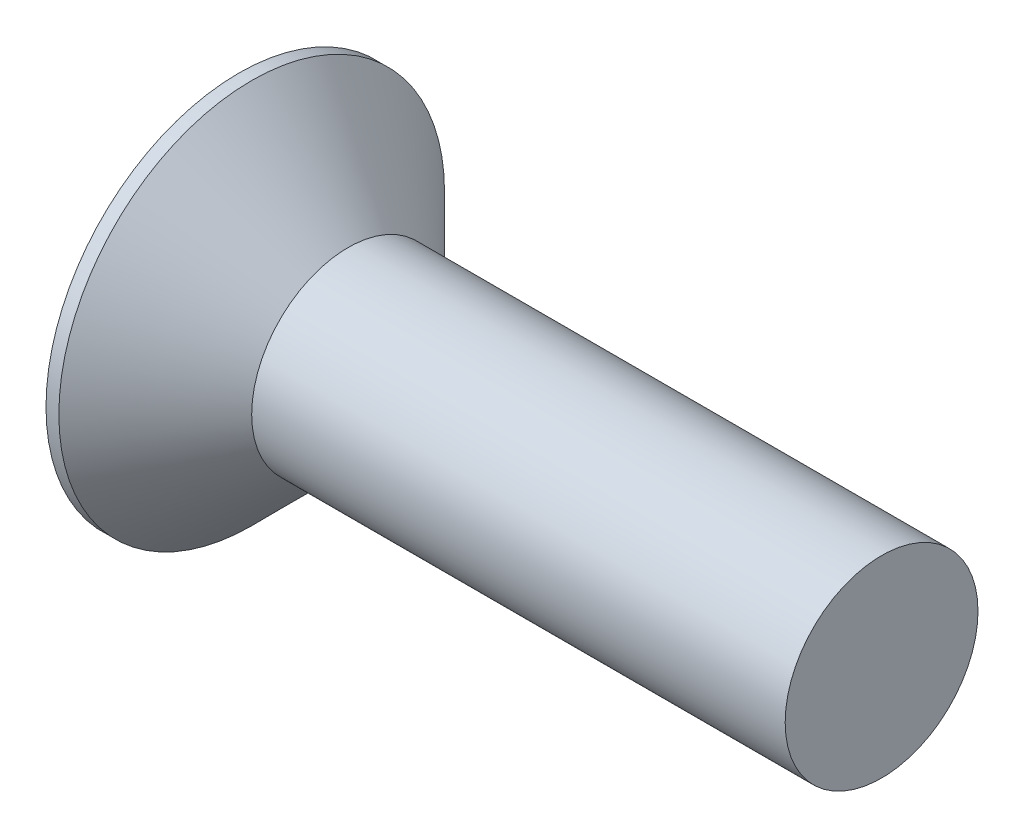
ISO-10303-21;
HEADER;
FILE_DESCRIPTION(('STEP AP214'),'2;1');
FILE_NAME('part.step','',(''),(''),'','','');
FILE_SCHEMA(('AUTOMOTIVE_DESIGN { 1 0 10303 214 1 1 1 1 }'));
ENDSEC;
DATA;
#1=APPLICATION_CONTEXT('core data for automotive mechanical design processes');
#2=APPLICATION_PROTOCOL_DEFINITION('international standard','automotive_design',2000,#1);
#3=PRODUCT_CONTEXT('',#1,'mechanical');
#4=PRODUCT('Part','Part','',(#3));
#5=PRODUCT_RELATED_PRODUCT_CATEGORY('part','',(#4));
#6=PRODUCT_DEFINITION_FORMATION('','',#4);
#7=PRODUCT_DEFINITION_CONTEXT('part definition',#1,'design');
#8=PRODUCT_DEFINITION('design','',#6,#7);
#9=PRODUCT_DEFINITION_SHAPE('','',#8);
#10=(LENGTH_UNIT() NAMED_UNIT(*) SI_UNIT(.MILLI.,.METRE.));
#11=(NAMED_UNIT(*) PLANE_ANGLE_UNIT() SI_UNIT($,.RADIAN.));
#12=(NAMED_UNIT(*) SI_UNIT($,.STERADIAN.) SOLID_ANGLE_UNIT());
#13=UNCERTAINTY_MEASURE_WITH_UNIT(LENGTH_MEASURE(1.E-05),#10,'distance_accuracy_value','');
#14=(GEOMETRIC_REPRESENTATION_CONTEXT(3) GLOBAL_UNCERTAINTY_ASSIGNED_CONTEXT((#13)) GLOBAL_UNIT_ASSIGNED_CONTEXT((#10,
#11,#12)) REPRESENTATION_CONTEXT('',''));
#15=CARTESIAN_POINT('',(0.,0.,0.));
#16=DIRECTION('',(0.,0.,1.));
#17=DIRECTION('',(1.,0.,0.));
#18=AXIS2_PLACEMENT_3D('',#15,#16,#17);
#19=CARTESIAN_POINT('',(-1.7,0.,0.));
#20=DIRECTION('',(1.,0.,0.));
#21=DIRECTION('',(0.,0.,-1.));
#22=AXIS2_PLACEMENT_3D('',#19,#20,#21);
#23=PLANE('',#22);
#24=DIRECTION('',(0.,-0.5,-0.866025403784439));
#25=VECTOR('',#24,1.);
#26=CARTESIAN_POINT('',(-1.7,1.15470053837925,0.));
#27=LINE('',#26,#25);
#28=CARTESIAN_POINT('',(-1.7,1.15470053837925,0.));
#29=VERTEX_POINT('',#28);
#30=CARTESIAN_POINT('',(-1.7,0.577350269189626,-1.));
#31=VERTEX_POINT('',#30);
#32=EDGE_CURVE('E55',#29,#31,#27,.T.);
#33=ORIENTED_EDGE('',*,*,#32,.F.);
#34=DIRECTION('',(0.,0.5,-0.866025403784439));
#35=VECTOR('',#34,1.);
#36=CARTESIAN_POINT('',(-1.7,0.577350269189626,1.));
#37=LINE('',#36,#35);
#38=CARTESIAN_POINT('',(-1.7,0.577350269189626,1.));
#39=VERTEX_POINT('',#38);
#40=EDGE_CURVE('E129',#39,#29,#37,.T.);
#41=ORIENTED_EDGE('',*,*,#40,.F.);
#42=DIRECTION('',(0.,1.,0.));
#43=VECTOR('',#42,1.);
#44=CARTESIAN_POINT('',(-1.7,-0.577350269189626,1.));
#45=LINE('',#44,#43);
#46=CARTESIAN_POINT('',(-1.7,-0.577350269189626,1.));
#47=VERTEX_POINT('',#46);
#48=EDGE_CURVE('E123',#47,#39,#45,.T.);
#49=ORIENTED_EDGE('',*,*,#48,.F.);
#50=DIRECTION('',(0.,0.5,0.866025403784439));
#51=VECTOR('',#50,1.);
#52=CARTESIAN_POINT('',(-1.7,-1.15470053837925,0.));
#53=LINE('',#52,#51);
#54=CARTESIAN_POINT('',(-1.7,-1.15470053837925,0.));
#55=VERTEX_POINT('',#54);
#56=EDGE_CURVE('E163',#55,#47,#53,.T.);
#57=ORIENTED_EDGE('',*,*,#56,.F.);
#58=DIRECTION('',(0.,-0.5,0.866025403784438));
#59=VECTOR('',#58,1.);
#60=CARTESIAN_POINT('',(-1.7,-0.577350269189626,-1.));
#61=LINE('',#60,#59);
#62=CARTESIAN_POINT('',(-1.7,-0.577350269189626,-1.));
#63=VERTEX_POINT('',#62);
#64=EDGE_CURVE('E160',#63,#55,#61,.T.);
#65=ORIENTED_EDGE('',*,*,#64,.F.);
#66=DIRECTION('',(0.,-1.,0.));
#67=VECTOR('',#66,1.);
#68=CARTESIAN_POINT('',(-1.7,0.577350269189626,-1.));
#69=LINE('',#68,#67);
#70=EDGE_CURVE('E157',#31,#63,#69,.T.);
#71=ORIENTED_EDGE('',*,*,#70,.F.);
#72=EDGE_LOOP('',(#33,#41,#49,#57,#65,#71));
#73=FACE_BOUND('',#72,.T.);
#74=CARTESIAN_POINT('',(-1.7,0.,0.));
#75=DIRECTION('',(-1.,0.,0.));
#76=DIRECTION('',(0.,0.,1.));
#77=AXIS2_PLACEMENT_3D('',#74,#75,#76);
#78=CIRCLE('',#77,3.);
#79=CARTESIAN_POINT('',(-1.7,0.,3.));
#80=VERTEX_POINT('',#79);
#81=EDGE_CURVE('E11',#80,#80,#78,.T.);
#82=ORIENTED_EDGE('',*,*,#81,.T.);
#83=EDGE_LOOP('',(#82));
#84=FACE_BOUND('',#83,.T.);
#85=ADVANCED_FACE('F41',(#73,#84),#23,.F.);
#86=CARTESIAN_POINT('',(-1.7,0.,0.));
#87=DIRECTION('',(-1.,0.,0.));
#88=DIRECTION('',(0.,0.,1.));
#89=AXIS2_PLACEMENT_3D('',#86,#87,#88);
#90=CYLINDRICAL_SURFACE('',#89,3.);
#91=ORIENTED_EDGE('',*,*,#81,.F.);
#92=EDGE_LOOP('',(#91));
#93=FACE_BOUND('',#92,.T.);
#94=CARTESIAN_POINT('',(-1.5,0.,0.));
#95=DIRECTION('',(-1.,0.,0.));
#96=DIRECTION('',(0.,0.,1.));
#97=AXIS2_PLACEMENT_3D('',#94,#95,#96);
#98=CIRCLE('',#97,3.);
#99=CARTESIAN_POINT('',(-1.5,0.,3.));
#100=VERTEX_POINT('',#99);
#101=EDGE_CURVE('E48',#100,#100,#98,.T.);
#102=ORIENTED_EDGE('',*,*,#101,.T.);
#103=EDGE_LOOP('',(#102));
#104=FACE_BOUND('',#103,.T.);
#105=ADVANCED_FACE('F191',(#93,#104),#90,.T.);
#106=CARTESIAN_POINT('',(0.,0.,0.));
#107=DIRECTION('',(-1.,0.,0.));
#108=DIRECTION('',(0.,0.,1.));
#109=AXIS2_PLACEMENT_3D('',#106,#107,#108);
#110=CONICAL_SURFACE('',#109,1.5,0.785398163397448);
#111=ORIENTED_EDGE('',*,*,#101,.F.);
#112=EDGE_LOOP('',(#111));
#113=FACE_BOUND('',#112,.T.);
#114=CARTESIAN_POINT('',(0.,0.,0.));
#115=DIRECTION('',(-1.,0.,0.));
#116=DIRECTION('',(0.,0.,1.));
#117=AXIS2_PLACEMENT_3D('',#114,#115,#116);
#118=CIRCLE('',#117,1.5);
#119=CARTESIAN_POINT('',(0.,0.,1.5));
#120=VERTEX_POINT('',#119);
#121=EDGE_CURVE('E186',#120,#120,#118,.T.);
#122=ORIENTED_EDGE('',*,*,#121,.T.);
#123=EDGE_LOOP('',(#122));
#124=FACE_BOUND('',#123,.T.);
#125=ADVANCED_FACE('F193',(#113,#124),#110,.T.);
#126=CARTESIAN_POINT('',(-1.7,0.,0.));
#127=DIRECTION('',(-1.,0.,0.));
#128=DIRECTION('',(0.,0.,1.));
#129=AXIS2_PLACEMENT_3D('',#126,#127,#128);
#130=CYLINDRICAL_SURFACE('',#129,1.5);
#131=ORIENTED_EDGE('',*,*,#121,.F.);
#132=EDGE_LOOP('',(#131));
#133=FACE_BOUND('',#132,.T.);
#134=CARTESIAN_POINT('',(8.3,0.,0.));
#135=DIRECTION('',(-1.,0.,0.));
#136=DIRECTION('',(0.,0.,1.));
#137=AXIS2_PLACEMENT_3D('',#134,#135,#136);
#138=CIRCLE('',#137,1.5);
#139=CARTESIAN_POINT('',(8.3,0.,1.5));
#140=VERTEX_POINT('',#139);
#141=EDGE_CURVE('E182',#140,#140,#138,.T.);
#142=ORIENTED_EDGE('',*,*,#141,.T.);
#143=EDGE_LOOP('',(#142));
#144=FACE_BOUND('',#143,.T.);
#145=ADVANCED_FACE('F196',(#133,#144),#130,.T.);
#146=CARTESIAN_POINT('',(8.3,1.5,0.));
#147=DIRECTION('',(-1.,0.,0.));
#148=DIRECTION('',(0.,0.,1.));
#149=AXIS2_PLACEMENT_3D('',#146,#147,#148);
#150=PLANE('',#149);
#151=ORIENTED_EDGE('',*,*,#141,.F.);
#152=EDGE_LOOP('',(#151));
#153=FACE_BOUND('',#152,.T.);
#154=ADVANCED_FACE('F202',(#153),#150,.F.);
#155=CARTESIAN_POINT('',(-0.85,0.577350269189626,1.));
#156=DIRECTION('',(0.,0.866025403784439,0.5));
#157=DIRECTION('',(0.,-0.5,0.866025403784439));
#158=AXIS2_PLACEMENT_3D('',#155,#156,#157);
#159=PLANE('',#158);
#160=DIRECTION('',(0.,0.5,-0.866025403784439));
#161=VECTOR('',#160,1.);
#162=CARTESIAN_POINT('',(-0.85,0.577350269189626,1.));
#163=LINE('',#162,#161);
#164=CARTESIAN_POINT('',(-0.85,0.577350269189626,1.));
#165=VERTEX_POINT('',#164);
#166=CARTESIAN_POINT('',(-0.85,0.866025403784438,0.5));
#167=VERTEX_POINT('',#166);
#168=EDGE_CURVE('E63',#165,#167,#163,.T.);
#169=ORIENTED_EDGE('',*,*,#168,.F.);
#170=DIRECTION('',(-1.,0.,0.));
#171=VECTOR('',#170,1.);
#172=CARTESIAN_POINT('',(-0.85,0.577350269189626,1.));
#173=LINE('',#172,#171);
#174=EDGE_CURVE('E167',#165,#39,#173,.T.);
#175=ORIENTED_EDGE('',*,*,#174,.T.);
#176=ORIENTED_EDGE('',*,*,#40,.T.);
#177=DIRECTION('',(-1.,0.,0.));
#178=VECTOR('',#177,1.);
#179=CARTESIAN_POINT('',(-0.85,1.15470053837925,0.));
#180=LINE('',#179,#178);
#181=CARTESIAN_POINT('',(-0.85,1.15470053837925,0.));
#182=VERTEX_POINT('',#181);
#183=EDGE_CURVE('E126',#182,#29,#180,.T.);
#184=ORIENTED_EDGE('',*,*,#183,.F.);
#185=EDGE_CURVE('E114',#167,#182,#163,.T.);
#186=ORIENTED_EDGE('',*,*,#185,.F.);
#187=EDGE_LOOP('',(#169,#175,#176,#184,#186));
#188=FACE_BOUND('',#187,.T.);
#189=ADVANCED_FACE('F127',(#188),#159,.F.);
#190=CARTESIAN_POINT('',(-0.85,-0.577350269189626,1.));
#191=DIRECTION('',(0.,0.,1.));
#192=DIRECTION('',(0.,-1.,0.));
#193=AXIS2_PLACEMENT_3D('',#190,#191,#192);
#194=PLANE('',#193);
#195=DIRECTION('',(0.,1.,0.));
#196=VECTOR('',#195,1.);
#197=CARTESIAN_POINT('',(-0.85,-0.577350269189626,1.));
#198=LINE('',#197,#196);
#199=CARTESIAN_POINT('',(-0.85,-0.577350269189626,1.));
#200=VERTEX_POINT('',#199);
#201=CARTESIAN_POINT('',(-0.85,0.,1.));
#202=VERTEX_POINT('',#201);
#203=EDGE_CURVE('E132',#200,#202,#198,.T.);
#204=ORIENTED_EDGE('',*,*,#203,.F.);
#205=DIRECTION('',(-1.,0.,0.));
#206=VECTOR('',#205,1.);
#207=CARTESIAN_POINT('',(-0.85,-0.577350269189626,1.));
#208=LINE('',#207,#206);
#209=EDGE_CURVE('E169',#200,#47,#208,.T.);
#210=ORIENTED_EDGE('',*,*,#209,.T.);
#211=ORIENTED_EDGE('',*,*,#48,.T.);
#212=ORIENTED_EDGE('',*,*,#174,.F.);
#213=EDGE_CURVE('E152',#202,#165,#198,.T.);
#214=ORIENTED_EDGE('',*,*,#213,.F.);
#215=EDGE_LOOP('',(#204,#210,#211,#212,#214));
#216=FACE_BOUND('',#215,.T.);
#217=ADVANCED_FACE('F211',(#216),#194,.F.);
#218=CARTESIAN_POINT('',(-0.85,-1.15470053837925,0.));
#219=DIRECTION('',(0.,-0.866025403784439,0.5));
#220=DIRECTION('',(0.,-0.5,-0.866025403784439));
#221=AXIS2_PLACEMENT_3D('',#218,#219,#220);
#222=PLANE('',#221);
#223=DIRECTION('',(0.,0.5,0.866025403784439));
#224=VECTOR('',#223,1.);
#225=CARTESIAN_POINT('',(-0.85,-1.15470053837925,0.));
#226=LINE('',#225,#224);
#227=CARTESIAN_POINT('',(-0.85,-1.15470053837925,0.));
#228=VERTEX_POINT('',#227);
#229=CARTESIAN_POINT('',(-0.85,-0.866025403784439,0.5));
#230=VERTEX_POINT('',#229);
#231=EDGE_CURVE('E149',#228,#230,#226,.T.);
#232=ORIENTED_EDGE('',*,*,#231,.F.);
#233=DIRECTION('',(-1.,0.,0.));
#234=VECTOR('',#233,1.);
#235=CARTESIAN_POINT('',(-0.85,-1.15470053837925,0.));
#236=LINE('',#235,#234);
#237=EDGE_CURVE('E172',#228,#55,#236,.T.);
#238=ORIENTED_EDGE('',*,*,#237,.T.);
#239=ORIENTED_EDGE('',*,*,#56,.T.);
#240=ORIENTED_EDGE('',*,*,#209,.F.);
#241=EDGE_CURVE('E148',#230,#200,#226,.T.);
#242=ORIENTED_EDGE('',*,*,#241,.F.);
#243=EDGE_LOOP('',(#232,#238,#239,#240,#242));
#244=FACE_BOUND('',#243,.T.);
#245=ADVANCED_FACE('F275',(#244),#222,.F.);
#246=CARTESIAN_POINT('',(-0.85,-0.577350269189626,-1.));
#247=DIRECTION('',(0.,-0.866025403784439,-0.5));
#248=DIRECTION('',(0.,0.5,-0.866025403784439));
#249=AXIS2_PLACEMENT_3D('',#246,#247,#248);
#250=PLANE('',#249);
#251=DIRECTION('',(0.,-0.5,0.866025403784438));
#252=VECTOR('',#251,1.);
#253=CARTESIAN_POINT('',(-0.85,-0.577350269189626,-1.));
#254=LINE('',#253,#252);
#255=CARTESIAN_POINT('',(-0.85,-0.577350269189626,-1.));
#256=VERTEX_POINT('',#255);
#257=CARTESIAN_POINT('',(-0.85,-0.866025403784438,-0.5));
#258=VERTEX_POINT('',#257);
#259=EDGE_CURVE('E145',#256,#258,#254,.T.);
#260=ORIENTED_EDGE('',*,*,#259,.F.);
#261=DIRECTION('',(-1.,0.,0.));
#262=VECTOR('',#261,1.);
#263=CARTESIAN_POINT('',(-0.85,-0.577350269189626,-1.));
#264=LINE('',#263,#262);
#265=EDGE_CURVE('E175',#256,#63,#264,.T.);
#266=ORIENTED_EDGE('',*,*,#265,.T.);
#267=ORIENTED_EDGE('',*,*,#64,.T.);
#268=ORIENTED_EDGE('',*,*,#237,.F.);
#269=EDGE_CURVE('E144',#258,#228,#254,.T.);
#270=ORIENTED_EDGE('',*,*,#269,.F.);
#271=EDGE_LOOP('',(#260,#266,#267,#268,#270));
#272=FACE_BOUND('',#271,.T.);
#273=ADVANCED_FACE('F286',(#272),#250,.F.);
#274=CARTESIAN_POINT('',(-0.85,0.577350269189626,-1.));
#275=DIRECTION('',(0.,0.,-1.));
#276=DIRECTION('',(0.,1.,0.));
#277=AXIS2_PLACEMENT_3D('',#274,#275,#276);
#278=PLANE('',#277);
#279=DIRECTION('',(0.,-1.,0.));
#280=VECTOR('',#279,1.);
#281=CARTESIAN_POINT('',(-0.85,0.577350269189626,-1.));
#282=LINE('',#281,#280);
#283=CARTESIAN_POINT('',(-0.85,0.577350269189626,-1.));
#284=VERTEX_POINT('',#283);
#285=CARTESIAN_POINT('',(-0.85,0.,-1.));
#286=VERTEX_POINT('',#285);
#287=EDGE_CURVE('E140',#284,#286,#282,.T.);
#288=ORIENTED_EDGE('',*,*,#287,.F.);
#289=DIRECTION('',(-1.,0.,0.));
#290=VECTOR('',#289,1.);
#291=CARTESIAN_POINT('',(-0.85,0.577350269189626,-1.));
#292=LINE('',#291,#290);
#293=EDGE_CURVE('E131',#284,#31,#292,.T.);
#294=ORIENTED_EDGE('',*,*,#293,.T.);
#295=ORIENTED_EDGE('',*,*,#70,.T.);
#296=ORIENTED_EDGE('',*,*,#265,.F.);
#297=EDGE_CURVE('E138',#286,#256,#282,.T.);
#298=ORIENTED_EDGE('',*,*,#297,.F.);
#299=EDGE_LOOP('',(#288,#294,#295,#296,#298));
#300=FACE_BOUND('',#299,.T.);
#301=ADVANCED_FACE('F297',(#300),#278,.F.);
#302=CARTESIAN_POINT('',(-0.85,1.15470053837925,0.));
#303=DIRECTION('',(0.,0.866025403784439,-0.5));
#304=DIRECTION('',(0.,0.5,0.866025403784439));
#305=AXIS2_PLACEMENT_3D('',#302,#303,#304);
#306=PLANE('',#305);
#307=DIRECTION('',(0.,-0.5,-0.866025403784439));
#308=VECTOR('',#307,1.);
#309=CARTESIAN_POINT('',(-0.85,1.15470053837925,0.));
#310=LINE('',#309,#308);
#311=CARTESIAN_POINT('',(-0.85,0.866025403784439,-0.5));
#312=VERTEX_POINT('',#311);
#313=EDGE_CURVE('E118',#182,#312,#310,.T.);
#314=ORIENTED_EDGE('',*,*,#313,.F.);
#315=ORIENTED_EDGE('',*,*,#183,.T.);
#316=ORIENTED_EDGE('',*,*,#32,.T.);
#317=ORIENTED_EDGE('',*,*,#293,.F.);
#318=EDGE_CURVE('E137',#312,#284,#310,.T.);
#319=ORIENTED_EDGE('',*,*,#318,.F.);
#320=EDGE_LOOP('',(#314,#315,#316,#317,#319));
#321=FACE_BOUND('',#320,.T.);
#322=ADVANCED_FACE('F135',(#321),#306,.F.);
#323=CARTESIAN_POINT('',(-0.85,0.,0.));
#324=DIRECTION('',(-1.,0.,0.));
#325=DIRECTION('',(0.,0.,1.));
#326=AXIS2_PLACEMENT_3D('',#323,#324,#325);
#327=PLANE('',#326);
#328=CARTESIAN_POINT('',(-0.85,0.,0.));
#329=DIRECTION('',(1.,0.,0.));
#330=DIRECTION('',(0.,1.,0.));
#331=AXIS2_PLACEMENT_3D('',#328,#329,#330);
#332=CIRCLE('',#331,1.);
#333=EDGE_CURVE('E183',#202,#230,#332,.T.);
#334=ORIENTED_EDGE('',*,*,#333,.T.);
#335=ORIENTED_EDGE('',*,*,#241,.T.);
#336=ORIENTED_EDGE('',*,*,#203,.T.);
#337=EDGE_LOOP('',(#334,#335,#336));
#338=FACE_BOUND('',#337,.T.);
#339=ADVANCED_FACE('F318',(#338),#327,.T.);
#340=EDGE_CURVE('E428',#230,#258,#332,.T.);
#341=ORIENTED_EDGE('',*,*,#340,.T.);
#342=ORIENTED_EDGE('',*,*,#269,.T.);
#343=ORIENTED_EDGE('',*,*,#231,.T.);
#344=EDGE_LOOP('',(#341,#342,#343));
#345=FACE_BOUND('',#344,.T.);
#346=ADVANCED_FACE('F328',(#345),#327,.T.);
#347=EDGE_CURVE('E430',#258,#286,#332,.T.);
#348=ORIENTED_EDGE('',*,*,#347,.T.);
#349=ORIENTED_EDGE('',*,*,#297,.T.);
#350=ORIENTED_EDGE('',*,*,#259,.T.);
#351=EDGE_LOOP('',(#348,#349,#350));
#352=FACE_BOUND('',#351,.T.);
#353=ADVANCED_FACE('F340',(#352),#327,.T.);
#354=EDGE_CURVE('E431',#286,#312,#332,.T.);
#355=ORIENTED_EDGE('',*,*,#354,.T.);
#356=ORIENTED_EDGE('',*,*,#318,.T.);
#357=ORIENTED_EDGE('',*,*,#287,.T.);
#358=EDGE_LOOP('',(#355,#356,#357));
#359=FACE_BOUND('',#358,.T.);
#360=ADVANCED_FACE('F350',(#359),#327,.T.);
#361=EDGE_CURVE('E120',#312,#167,#332,.T.);
#362=ORIENTED_EDGE('',*,*,#361,.T.);
#363=ORIENTED_EDGE('',*,*,#185,.T.);
#364=ORIENTED_EDGE('',*,*,#313,.T.);
#365=EDGE_LOOP('',(#362,#363,#364));
#366=FACE_BOUND('',#365,.T.);
#367=ADVANCED_FACE('F116',(#366),#327,.T.);
#368=EDGE_CURVE('E180',#167,#202,#332,.T.);
#369=ORIENTED_EDGE('',*,*,#368,.T.);
#370=ORIENTED_EDGE('',*,*,#213,.T.);
#371=ORIENTED_EDGE('',*,*,#168,.T.);
#372=EDGE_LOOP('',(#369,#370,#371));
#373=FACE_BOUND('',#372,.T.);
#374=ADVANCED_FACE('F331',(#373),#327,.T.);
#375=CARTESIAN_POINT('',(-0.249139380972443,0.,0.));
#376=DIRECTION('',(-1.,0.,0.));
#377=DIRECTION('',(0.,-1.,0.));
#378=AXIS2_PLACEMENT_3D('',#375,#376,#377);
#379=CONICAL_SURFACE('',#378,0.,1.02974425867666);
#380=ORIENTED_EDGE('',*,*,#368,.F.);
#381=ORIENTED_EDGE('',*,*,#361,.F.);
#382=ORIENTED_EDGE('',*,*,#354,.F.);
#383=ORIENTED_EDGE('',*,*,#347,.F.);
#384=ORIENTED_EDGE('',*,*,#340,.F.);
#385=ORIENTED_EDGE('',*,*,#333,.F.);
#386=EDGE_LOOP('',(#380,#381,#382,#383,#384,#385));
#387=FACE_BOUND('',#386,.T.);
#388=CARTESIAN_POINT('',(-0.249139380972443,0.,0.));
#389=VERTEX_POINT('',#388);
#390=VERTEX_LOOP('',#389);
#391=FACE_BOUND('',#390,.T.);
#392=ADVANCED_FACE('F377',(#387,#391),#379,.F.);
#393=CLOSED_SHELL('',(#85,#105,#125,#145,#154,#189,#217,#245,#273,#301,#322,#339,#346,#353,#360,
#367,#374,#392));
#394=MANIFOLD_SOLID_BREP('B2',#393);
#395=ADVANCED_BREP_SHAPE_REPRESENTATION('',(#18,#394),#14);
#396=SHAPE_DEFINITION_REPRESENTATION(#9,#395);
ENDSEC;
END-ISO-10303-21;
